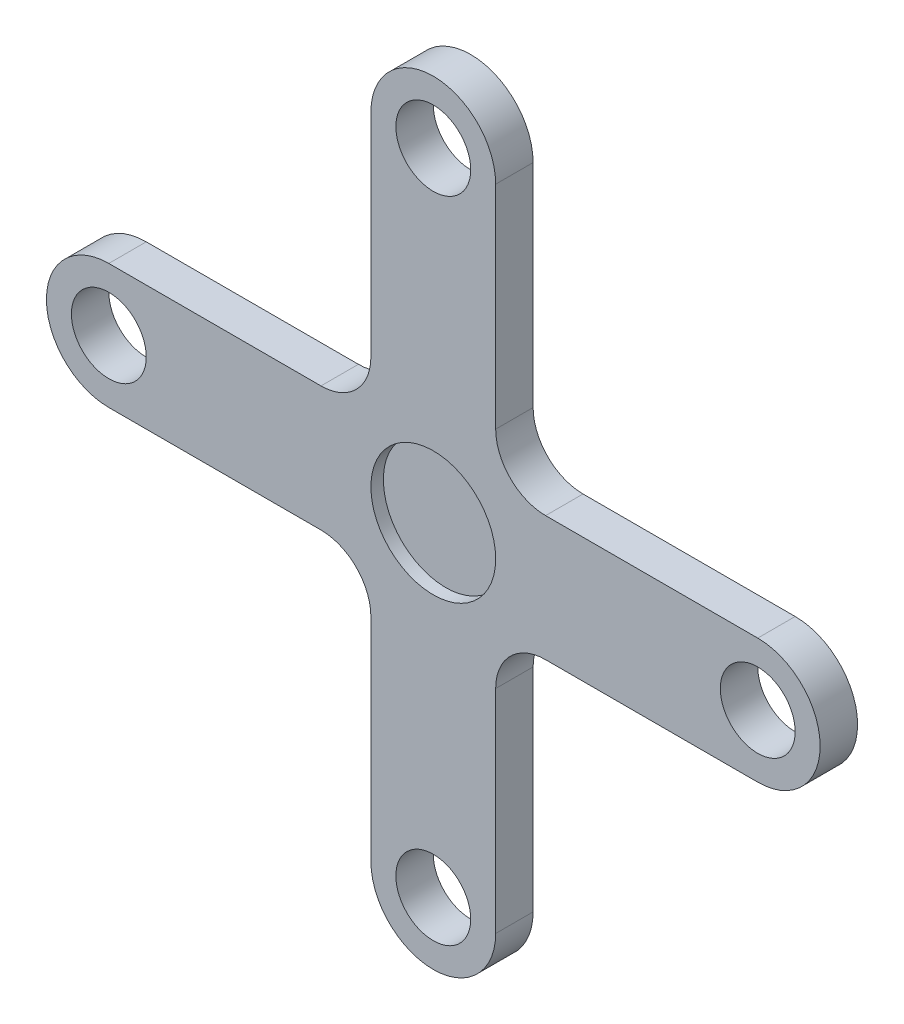
ISO-10303-21;
HEADER;
FILE_DESCRIPTION(('STEP AP214'),'2;1');
FILE_NAME('part.step','',(''),(''),'','','');
FILE_SCHEMA(('AUTOMOTIVE_DESIGN { 1 0 10303 214 1 1 1 1 }'));
ENDSEC;
DATA;
#1=APPLICATION_CONTEXT('core data for automotive mechanical design processes');
#2=APPLICATION_PROTOCOL_DEFINITION('international standard','automotive_design',2000,#1);
#3=PRODUCT_CONTEXT('',#1,'mechanical');
#4=PRODUCT('Part','Part','',(#3));
#5=PRODUCT_RELATED_PRODUCT_CATEGORY('part','',(#4));
#6=PRODUCT_DEFINITION_FORMATION('','',#4);
#7=PRODUCT_DEFINITION_CONTEXT('part definition',#1,'design');
#8=PRODUCT_DEFINITION('design','',#6,#7);
#9=PRODUCT_DEFINITION_SHAPE('','',#8);
#10=(LENGTH_UNIT() NAMED_UNIT(*) SI_UNIT(.MILLI.,.METRE.));
#11=(NAMED_UNIT(*) PLANE_ANGLE_UNIT() SI_UNIT($,.RADIAN.));
#12=(NAMED_UNIT(*) SI_UNIT($,.STERADIAN.) SOLID_ANGLE_UNIT());
#13=UNCERTAINTY_MEASURE_WITH_UNIT(LENGTH_MEASURE(1.E-05),#10,'distance_accuracy_value','');
#14=(GEOMETRIC_REPRESENTATION_CONTEXT(3) GLOBAL_UNCERTAINTY_ASSIGNED_CONTEXT((#13)) GLOBAL_UNIT_ASSIGNED_CONTEXT((#10,
#11,#12)) REPRESENTATION_CONTEXT('',''));
#15=CARTESIAN_POINT('',(0.,0.,0.));
#16=DIRECTION('',(0.,0.,1.));
#17=DIRECTION('',(1.,0.,0.));
#18=AXIS2_PLACEMENT_3D('',#15,#16,#17);
#19=CARTESIAN_POINT('',(0.,-13.,1.5));
#20=DIRECTION('',(0.,0.,1.));
#21=DIRECTION('',(1.,0.,0.));
#22=AXIS2_PLACEMENT_3D('',#19,#20,#21);
#23=PLANE('',#22);
#24=CARTESIAN_POINT('',(0.,0.,1.5));
#25=DIRECTION('',(0.,0.,1.));
#26=DIRECTION('',(1.,0.,0.));
#27=AXIS2_PLACEMENT_3D('',#24,#25,#26);
#28=CIRCLE('',#27,2.5);
#29=CARTESIAN_POINT('',(2.5,0.,1.5));
#30=VERTEX_POINT('',#29);
#31=EDGE_CURVE('E342',#30,#30,#28,.T.);
#32=ORIENTED_EDGE('',*,*,#31,.F.);
#33=EDGE_LOOP('',(#32));
#34=FACE_BOUND('',#33,.T.);
#35=CARTESIAN_POINT('',(7.31865969776296E-13,-13.,1.5));
#36=DIRECTION('',(0.,0.,1.));
#37=DIRECTION('',(1.,0.,0.));
#38=AXIS2_PLACEMENT_3D('',#35,#36,#37);
#39=CIRCLE('',#38,1.50000000000078);
#40=CARTESIAN_POINT('',(1.50000000000151,-13.,1.5));
#41=VERTEX_POINT('',#40);
#42=EDGE_CURVE('E353',#41,#41,#39,.T.);
#43=ORIENTED_EDGE('',*,*,#42,.F.);
#44=EDGE_LOOP('',(#43));
#45=FACE_BOUND('',#44,.T.);
#46=CARTESIAN_POINT('',(0.,13.,1.5));
#47=DIRECTION('',(0.,0.,1.));
#48=DIRECTION('',(1.,0.,0.));
#49=AXIS2_PLACEMENT_3D('',#46,#47,#48);
#50=CIRCLE('',#49,1.5);
#51=CARTESIAN_POINT('',(1.5,13.,1.5));
#52=VERTEX_POINT('',#51);
#53=EDGE_CURVE('E181',#52,#52,#50,.T.);
#54=ORIENTED_EDGE('',*,*,#53,.F.);
#55=EDGE_LOOP('',(#54));
#56=FACE_BOUND('',#55,.T.);
#57=CARTESIAN_POINT('',(0.,-13.,1.5));
#58=DIRECTION('',(0.,0.,1.));
#59=DIRECTION('',(1.,0.,0.));
#60=AXIS2_PLACEMENT_3D('',#57,#58,#59);
#61=CIRCLE('',#60,2.5);
#62=CARTESIAN_POINT('',(-2.5,-13.,1.5));
#63=VERTEX_POINT('',#62);
#64=CARTESIAN_POINT('',(2.5,-13.,1.5));
#65=VERTEX_POINT('',#64);
#66=EDGE_CURVE('E208',#63,#65,#61,.T.);
#67=ORIENTED_EDGE('',*,*,#66,.T.);
#68=DIRECTION('',(0.,1.,0.));
#69=VECTOR('',#68,1.);
#70=CARTESIAN_POINT('',(2.5,-13.,1.5));
#71=LINE('',#70,#69);
#72=CARTESIAN_POINT('',(2.5,-4.50000000000002,1.5));
#73=VERTEX_POINT('',#72);
#74=EDGE_CURVE('E116',#65,#73,#71,.T.);
#75=ORIENTED_EDGE('',*,*,#74,.T.);
#76=CARTESIAN_POINT('',(4.5,-4.5,1.5));
#77=DIRECTION('',(0.,0.,-1.));
#78=DIRECTION('',(1.,0.,0.));
#79=AXIS2_PLACEMENT_3D('',#76,#77,#78);
#80=CIRCLE('',#79,2.);
#81=CARTESIAN_POINT('',(4.50000000000002,-2.5,1.5));
#82=VERTEX_POINT('',#81);
#83=EDGE_CURVE('E247',#73,#82,#80,.T.);
#84=ORIENTED_EDGE('',*,*,#83,.T.);
#85=DIRECTION('',(1.,0.,0.));
#86=VECTOR('',#85,1.);
#87=CARTESIAN_POINT('',(4.50000000000002,-2.5,1.5));
#88=LINE('',#87,#86);
#89=CARTESIAN_POINT('',(13.,-2.5,1.5));
#90=VERTEX_POINT('',#89);
#91=EDGE_CURVE('E266',#82,#90,#88,.T.);
#92=ORIENTED_EDGE('',*,*,#91,.T.);
#93=CARTESIAN_POINT('',(13.,0.,1.5));
#94=DIRECTION('',(0.,0.,1.));
#95=DIRECTION('',(1.,0.,0.));
#96=AXIS2_PLACEMENT_3D('',#93,#94,#95);
#97=CIRCLE('',#96,2.5);
#98=CARTESIAN_POINT('',(13.,2.50000000000001,1.5));
#99=VERTEX_POINT('',#98);
#100=EDGE_CURVE('E263',#90,#99,#97,.T.);
#101=ORIENTED_EDGE('',*,*,#100,.T.);
#102=DIRECTION('',(-1.,0.,0.));
#103=VECTOR('',#102,1.);
#104=CARTESIAN_POINT('',(4.50000000000002,2.50000000000001,1.5));
#105=LINE('',#104,#103);
#106=CARTESIAN_POINT('',(4.50000000000002,2.50000000000001,1.5));
#107=VERTEX_POINT('',#106);
#108=EDGE_CURVE('E265',#99,#107,#105,.T.);
#109=ORIENTED_EDGE('',*,*,#108,.T.);
#110=CARTESIAN_POINT('',(4.5,4.50000000000001,1.5));
#111=DIRECTION('',(0.,0.,-1.));
#112=DIRECTION('',(1.,0.,0.));
#113=AXIS2_PLACEMENT_3D('',#110,#111,#112);
#114=CIRCLE('',#113,2.);
#115=CARTESIAN_POINT('',(2.5,4.50000000000002,1.5));
#116=VERTEX_POINT('',#115);
#117=EDGE_CURVE('E268',#107,#116,#114,.T.);
#118=ORIENTED_EDGE('',*,*,#117,.T.);
#119=DIRECTION('',(0.,1.,0.));
#120=VECTOR('',#119,1.);
#121=CARTESIAN_POINT('',(2.5,4.50000000000002,1.5));
#122=LINE('',#121,#120);
#123=CARTESIAN_POINT('',(2.5,13.,1.5));
#124=VERTEX_POINT('',#123);
#125=EDGE_CURVE('E274',#116,#124,#122,.T.);
#126=ORIENTED_EDGE('',*,*,#125,.T.);
#127=CARTESIAN_POINT('',(0.,13.,1.5));
#128=DIRECTION('',(0.,0.,1.));
#129=DIRECTION('',(1.,0.,0.));
#130=AXIS2_PLACEMENT_3D('',#127,#128,#129);
#131=CIRCLE('',#130,2.5);
#132=CARTESIAN_POINT('',(-2.50000000000001,13.,1.5));
#133=VERTEX_POINT('',#132);
#134=EDGE_CURVE('E276',#124,#133,#131,.T.);
#135=ORIENTED_EDGE('',*,*,#134,.T.);
#136=DIRECTION('',(0.,-1.,0.));
#137=VECTOR('',#136,1.);
#138=CARTESIAN_POINT('',(-2.50000000000001,4.50000000000002,1.5));
#139=LINE('',#138,#137);
#140=CARTESIAN_POINT('',(-2.50000000000001,4.50000000000001,1.5));
#141=VERTEX_POINT('',#140);
#142=EDGE_CURVE('E278',#133,#141,#139,.T.);
#143=ORIENTED_EDGE('',*,*,#142,.T.);
#144=CARTESIAN_POINT('',(-4.50000000000001,4.50000000000001,1.5));
#145=DIRECTION('',(0.,0.,-1.));
#146=DIRECTION('',(1.,0.,0.));
#147=AXIS2_PLACEMENT_3D('',#144,#145,#146);
#148=CIRCLE('',#147,2.);
#149=CARTESIAN_POINT('',(-4.50000000000002,2.50000000000001,1.5));
#150=VERTEX_POINT('',#149);
#151=EDGE_CURVE('E280',#141,#150,#148,.T.);
#152=ORIENTED_EDGE('',*,*,#151,.T.);
#153=DIRECTION('',(-1.,0.,0.));
#154=VECTOR('',#153,1.);
#155=CARTESIAN_POINT('',(-13.,2.5,1.5));
#156=LINE('',#155,#154);
#157=CARTESIAN_POINT('',(-13.,2.5,1.5));
#158=VERTEX_POINT('',#157);
#159=EDGE_CURVE('E282',#150,#158,#156,.T.);
#160=ORIENTED_EDGE('',*,*,#159,.T.);
#161=CARTESIAN_POINT('',(-13.,0.,1.5));
#162=DIRECTION('',(0.,0.,1.));
#163=DIRECTION('',(1.,0.,0.));
#164=AXIS2_PLACEMENT_3D('',#161,#162,#163);
#165=CIRCLE('',#164,2.5);
#166=CARTESIAN_POINT('',(-13.,-2.5,1.5));
#167=VERTEX_POINT('',#166);
#168=EDGE_CURVE('E159',#158,#167,#165,.T.);
#169=ORIENTED_EDGE('',*,*,#168,.T.);
#170=DIRECTION('',(1.,0.,0.));
#171=VECTOR('',#170,1.);
#172=CARTESIAN_POINT('',(-13.,-2.5,1.5));
#173=LINE('',#172,#171);
#174=CARTESIAN_POINT('',(-4.50000000000002,-2.5,1.5));
#175=VERTEX_POINT('',#174);
#176=EDGE_CURVE('E153',#167,#175,#173,.T.);
#177=ORIENTED_EDGE('',*,*,#176,.T.);
#178=CARTESIAN_POINT('',(-4.50000000000001,-4.5,1.5));
#179=DIRECTION('',(0.,0.,-1.));
#180=DIRECTION('',(1.,0.,0.));
#181=AXIS2_PLACEMENT_3D('',#178,#179,#180);
#182=CIRCLE('',#181,2.);
#183=CARTESIAN_POINT('',(-2.50000000000001,-4.50000000000002,1.5));
#184=VERTEX_POINT('',#183);
#185=EDGE_CURVE('E157',#175,#184,#182,.T.);
#186=ORIENTED_EDGE('',*,*,#185,.T.);
#187=DIRECTION('',(0.,-1.,0.));
#188=VECTOR('',#187,1.);
#189=CARTESIAN_POINT('',(-2.5,-13.,1.5));
#190=LINE('',#189,#188);
#191=EDGE_CURVE('E49',#184,#63,#190,.T.);
#192=ORIENTED_EDGE('',*,*,#191,.T.);
#193=EDGE_LOOP('',(#67,#75,#84,#92,#101,#109,#118,#126,#135,#143,#152,#160,#169,#177,#186,#192));
#194=FACE_BOUND('',#193,.T.);
#195=CARTESIAN_POINT('',(13.0000000000004,3.6875191053661E-13,1.5));
#196=DIRECTION('',(0.,0.,1.));
#197=DIRECTION('',(1.,0.,0.));
#198=AXIS2_PLACEMENT_3D('',#195,#196,#197);
#199=CIRCLE('',#198,1.50000000000028);
#200=CARTESIAN_POINT('',(14.5000000000007,3.6875191053661E-13,1.5));
#201=VERTEX_POINT('',#200);
#202=EDGE_CURVE('E359',#201,#201,#199,.T.);
#203=ORIENTED_EDGE('',*,*,#202,.F.);
#204=EDGE_LOOP('',(#203));
#205=FACE_BOUND('',#204,.T.);
#206=CARTESIAN_POINT('',(-12.9999999999996,-3.70343951375502E-13,1.5));
#207=DIRECTION('',(0.,0.,1.));
#208=DIRECTION('',(1.,0.,0.));
#209=AXIS2_PLACEMENT_3D('',#206,#207,#208);
#210=CIRCLE('',#209,1.50000000000059);
#211=CARTESIAN_POINT('',(-11.4999999999991,-3.70343951375502E-13,1.5));
#212=VERTEX_POINT('',#211);
#213=EDGE_CURVE('E345',#212,#212,#210,.T.);
#214=ORIENTED_EDGE('',*,*,#213,.F.);
#215=EDGE_LOOP('',(#214));
#216=FACE_BOUND('',#215,.T.);
#217=ADVANCED_FACE('F32',(#34,#45,#56,#194,#205,#216),#23,.T.);
#218=CARTESIAN_POINT('',(0.,-13.,0.));
#219=DIRECTION('',(0.,0.,1.));
#220=DIRECTION('',(1.,0.,0.));
#221=AXIS2_PLACEMENT_3D('',#218,#219,#220);
#222=PLANE('',#221);
#223=CARTESIAN_POINT('',(0.,-13.,0.));
#224=DIRECTION('',(0.,0.,1.));
#225=DIRECTION('',(1.,0.,0.));
#226=AXIS2_PLACEMENT_3D('',#223,#224,#225);
#227=CIRCLE('',#226,2.5);
#228=CARTESIAN_POINT('',(-2.5,-13.,0.));
#229=VERTEX_POINT('',#228);
#230=CARTESIAN_POINT('',(2.5,-13.,0.));
#231=VERTEX_POINT('',#230);
#232=EDGE_CURVE('E177',#229,#231,#227,.T.);
#233=ORIENTED_EDGE('',*,*,#232,.F.);
#234=DIRECTION('',(0.,-1.,0.));
#235=VECTOR('',#234,1.);
#236=CARTESIAN_POINT('',(-2.5,-13.,0.));
#237=LINE('',#236,#235);
#238=CARTESIAN_POINT('',(-2.50000000000001,-4.50000000000002,0.));
#239=VERTEX_POINT('',#238);
#240=EDGE_CURVE('E108',#239,#229,#237,.T.);
#241=ORIENTED_EDGE('',*,*,#240,.F.);
#242=CARTESIAN_POINT('',(-4.50000000000001,-4.5,0.));
#243=DIRECTION('',(0.,0.,-1.));
#244=DIRECTION('',(1.,0.,0.));
#245=AXIS2_PLACEMENT_3D('',#242,#243,#244);
#246=CIRCLE('',#245,2.);
#247=CARTESIAN_POINT('',(-4.50000000000002,-2.5,0.));
#248=VERTEX_POINT('',#247);
#249=EDGE_CURVE('E102',#248,#239,#246,.T.);
#250=ORIENTED_EDGE('',*,*,#249,.F.);
#251=DIRECTION('',(1.,0.,0.));
#252=VECTOR('',#251,1.);
#253=CARTESIAN_POINT('',(-13.,-2.5,0.));
#254=LINE('',#253,#252);
#255=CARTESIAN_POINT('',(-13.,-2.5,0.));
#256=VERTEX_POINT('',#255);
#257=EDGE_CURVE('E167',#256,#248,#254,.T.);
#258=ORIENTED_EDGE('',*,*,#257,.F.);
#259=CARTESIAN_POINT('',(-13.,0.,0.));
#260=DIRECTION('',(0.,0.,1.));
#261=DIRECTION('',(1.,0.,0.));
#262=AXIS2_PLACEMENT_3D('',#259,#260,#261);
#263=CIRCLE('',#262,2.5);
#264=CARTESIAN_POINT('',(-13.,2.5,0.));
#265=VERTEX_POINT('',#264);
#266=EDGE_CURVE('E203',#265,#256,#263,.T.);
#267=ORIENTED_EDGE('',*,*,#266,.F.);
#268=DIRECTION('',(-1.,0.,0.));
#269=VECTOR('',#268,1.);
#270=CARTESIAN_POINT('',(-13.,2.5,0.));
#271=LINE('',#270,#269);
#272=CARTESIAN_POINT('',(-4.50000000000002,2.50000000000001,0.));
#273=VERTEX_POINT('',#272);
#274=EDGE_CURVE('E201',#273,#265,#271,.T.);
#275=ORIENTED_EDGE('',*,*,#274,.F.);
#276=CARTESIAN_POINT('',(-4.50000000000001,4.50000000000001,0.));
#277=DIRECTION('',(0.,0.,-1.));
#278=DIRECTION('',(1.,0.,0.));
#279=AXIS2_PLACEMENT_3D('',#276,#277,#278);
#280=CIRCLE('',#279,2.);
#281=CARTESIAN_POINT('',(-2.50000000000001,4.50000000000001,0.));
#282=VERTEX_POINT('',#281);
#283=EDGE_CURVE('E199',#282,#273,#280,.T.);
#284=ORIENTED_EDGE('',*,*,#283,.F.);
#285=DIRECTION('',(0.,-1.,0.));
#286=VECTOR('',#285,1.);
#287=CARTESIAN_POINT('',(-2.50000000000001,4.50000000000002,0.));
#288=LINE('',#287,#286);
#289=CARTESIAN_POINT('',(-2.50000000000001,13.,0.));
#290=VERTEX_POINT('',#289);
#291=EDGE_CURVE('E197',#290,#282,#288,.T.);
#292=ORIENTED_EDGE('',*,*,#291,.F.);
#293=CARTESIAN_POINT('',(0.,13.,0.));
#294=DIRECTION('',(0.,0.,1.));
#295=DIRECTION('',(1.,0.,0.));
#296=AXIS2_PLACEMENT_3D('',#293,#294,#295);
#297=CIRCLE('',#296,2.5);
#298=CARTESIAN_POINT('',(2.5,13.,0.));
#299=VERTEX_POINT('',#298);
#300=EDGE_CURVE('E195',#299,#290,#297,.T.);
#301=ORIENTED_EDGE('',*,*,#300,.F.);
#302=DIRECTION('',(0.,1.,0.));
#303=VECTOR('',#302,1.);
#304=CARTESIAN_POINT('',(2.5,4.50000000000002,0.));
#305=LINE('',#304,#303);
#306=CARTESIAN_POINT('',(2.5,4.50000000000002,0.));
#307=VERTEX_POINT('',#306);
#308=EDGE_CURVE('E193',#307,#299,#305,.T.);
#309=ORIENTED_EDGE('',*,*,#308,.F.);
#310=CARTESIAN_POINT('',(4.5,4.50000000000001,0.));
#311=DIRECTION('',(0.,0.,-1.));
#312=DIRECTION('',(1.,0.,0.));
#313=AXIS2_PLACEMENT_3D('',#310,#311,#312);
#314=CIRCLE('',#313,2.);
#315=CARTESIAN_POINT('',(4.50000000000002,2.50000000000001,0.));
#316=VERTEX_POINT('',#315);
#317=EDGE_CURVE('E191',#316,#307,#314,.T.);
#318=ORIENTED_EDGE('',*,*,#317,.F.);
#319=DIRECTION('',(-1.,0.,0.));
#320=VECTOR('',#319,1.);
#321=CARTESIAN_POINT('',(4.50000000000002,2.50000000000001,0.));
#322=LINE('',#321,#320);
#323=CARTESIAN_POINT('',(13.,2.50000000000001,0.));
#324=VERTEX_POINT('',#323);
#325=EDGE_CURVE('E189',#324,#316,#322,.T.);
#326=ORIENTED_EDGE('',*,*,#325,.F.);
#327=CARTESIAN_POINT('',(13.,0.,0.));
#328=DIRECTION('',(0.,0.,1.));
#329=DIRECTION('',(1.,0.,0.));
#330=AXIS2_PLACEMENT_3D('',#327,#328,#329);
#331=CIRCLE('',#330,2.5);
#332=CARTESIAN_POINT('',(13.,-2.5,0.));
#333=VERTEX_POINT('',#332);
#334=EDGE_CURVE('E187',#333,#324,#331,.T.);
#335=ORIENTED_EDGE('',*,*,#334,.F.);
#336=DIRECTION('',(1.,0.,0.));
#337=VECTOR('',#336,1.);
#338=CARTESIAN_POINT('',(4.50000000000002,-2.5,0.));
#339=LINE('',#338,#337);
#340=CARTESIAN_POINT('',(4.50000000000002,-2.5,0.));
#341=VERTEX_POINT('',#340);
#342=EDGE_CURVE('E185',#341,#333,#339,.T.);
#343=ORIENTED_EDGE('',*,*,#342,.F.);
#344=CARTESIAN_POINT('',(4.5,-4.5,0.));
#345=DIRECTION('',(0.,0.,-1.));
#346=DIRECTION('',(1.,0.,0.));
#347=AXIS2_PLACEMENT_3D('',#344,#345,#346);
#348=CIRCLE('',#347,2.);
#349=CARTESIAN_POINT('',(2.5,-4.50000000000002,0.));
#350=VERTEX_POINT('',#349);
#351=EDGE_CURVE('E183',#350,#341,#348,.T.);
#352=ORIENTED_EDGE('',*,*,#351,.F.);
#353=DIRECTION('',(0.,1.,0.));
#354=VECTOR('',#353,1.);
#355=CARTESIAN_POINT('',(2.5,-13.,0.));
#356=LINE('',#355,#354);
#357=EDGE_CURVE('E180',#231,#350,#356,.T.);
#358=ORIENTED_EDGE('',*,*,#357,.F.);
#359=EDGE_LOOP('',(#233,#241,#250,#258,#267,#275,#284,#292,#301,#309,#318,#326,#335,#343,#352,#358));
#360=FACE_BOUND('',#359,.T.);
#361=CARTESIAN_POINT('',(0.,13.,0.));
#362=DIRECTION('',(0.,0.,1.));
#363=DIRECTION('',(1.,0.,0.));
#364=AXIS2_PLACEMENT_3D('',#361,#362,#363);
#365=CIRCLE('',#364,1.5);
#366=CARTESIAN_POINT('',(1.5,13.,0.));
#367=VERTEX_POINT('',#366);
#368=EDGE_CURVE('E362',#367,#367,#365,.T.);
#369=ORIENTED_EDGE('',*,*,#368,.T.);
#370=EDGE_LOOP('',(#369));
#371=FACE_BOUND('',#370,.T.);
#372=CARTESIAN_POINT('',(13.0000000000004,3.6875191053661E-13,0.));
#373=DIRECTION('',(0.,0.,1.));
#374=DIRECTION('',(1.,0.,0.));
#375=AXIS2_PLACEMENT_3D('',#372,#373,#374);
#376=CIRCLE('',#375,1.50000000000028);
#377=CARTESIAN_POINT('',(14.5000000000007,3.6875191053661E-13,0.));
#378=VERTEX_POINT('',#377);
#379=EDGE_CURVE('E356',#378,#378,#376,.T.);
#380=ORIENTED_EDGE('',*,*,#379,.T.);
#381=EDGE_LOOP('',(#380));
#382=FACE_BOUND('',#381,.T.);
#383=CARTESIAN_POINT('',(7.31865969776296E-13,-13.,0.));
#384=DIRECTION('',(0.,0.,1.));
#385=DIRECTION('',(1.,0.,0.));
#386=AXIS2_PLACEMENT_3D('',#383,#384,#385);
#387=CIRCLE('',#386,1.50000000000078);
#388=CARTESIAN_POINT('',(1.50000000000151,-13.,0.));
#389=VERTEX_POINT('',#388);
#390=EDGE_CURVE('E351',#389,#389,#387,.T.);
#391=ORIENTED_EDGE('',*,*,#390,.T.);
#392=EDGE_LOOP('',(#391));
#393=FACE_BOUND('',#392,.T.);
#394=CARTESIAN_POINT('',(-12.9999999999996,-3.70343951375502E-13,0.));
#395=DIRECTION('',(0.,0.,1.));
#396=DIRECTION('',(1.,0.,0.));
#397=AXIS2_PLACEMENT_3D('',#394,#395,#396);
#398=CIRCLE('',#397,1.50000000000059);
#399=CARTESIAN_POINT('',(-11.4999999999991,-3.70343951375502E-13,0.));
#400=VERTEX_POINT('',#399);
#401=EDGE_CURVE('E341',#400,#400,#398,.T.);
#402=ORIENTED_EDGE('',*,*,#401,.T.);
#403=EDGE_LOOP('',(#402));
#404=FACE_BOUND('',#403,.T.);
#405=ADVANCED_FACE('F251',(#360,#371,#382,#393,#404),#222,.F.);
#406=CARTESIAN_POINT('',(0.,-13.,1.5));
#407=DIRECTION('',(0.,0.,-1.));
#408=DIRECTION('',(-1.,0.,0.));
#409=AXIS2_PLACEMENT_3D('',#406,#407,#408);
#410=CYLINDRICAL_SURFACE('',#409,2.5);
#411=ORIENTED_EDGE('',*,*,#232,.T.);
#412=DIRECTION('',(0.,0.,-1.));
#413=VECTOR('',#412,1.);
#414=CARTESIAN_POINT('',(2.5,-13.,1.5));
#415=LINE('',#414,#413);
#416=EDGE_CURVE('E11',#65,#231,#415,.T.);
#417=ORIENTED_EDGE('',*,*,#416,.F.);
#418=ORIENTED_EDGE('',*,*,#66,.F.);
#419=DIRECTION('',(0.,0.,-1.));
#420=VECTOR('',#419,1.);
#421=CARTESIAN_POINT('',(-2.5,-13.,1.5));
#422=LINE('',#421,#420);
#423=EDGE_CURVE('E173',#63,#229,#422,.T.);
#424=ORIENTED_EDGE('',*,*,#423,.T.);
#425=EDGE_LOOP('',(#411,#417,#418,#424));
#426=FACE_BOUND('',#425,.T.);
#427=ADVANCED_FACE('F34',(#426),#410,.T.);
#428=CARTESIAN_POINT('',(2.5,-13.,1.5));
#429=DIRECTION('',(-1.,0.,0.));
#430=DIRECTION('',(0.,-1.,0.));
#431=AXIS2_PLACEMENT_3D('',#428,#429,#430);
#432=PLANE('',#431);
#433=ORIENTED_EDGE('',*,*,#357,.T.);
#434=DIRECTION('',(0.,0.,-1.));
#435=VECTOR('',#434,1.);
#436=CARTESIAN_POINT('',(2.5,-4.50000000000002,1.5));
#437=LINE('',#436,#435);
#438=EDGE_CURVE('E41',#73,#350,#437,.T.);
#439=ORIENTED_EDGE('',*,*,#438,.F.);
#440=ORIENTED_EDGE('',*,*,#74,.F.);
#441=ORIENTED_EDGE('',*,*,#416,.T.);
#442=EDGE_LOOP('',(#433,#439,#440,#441));
#443=FACE_BOUND('',#442,.T.);
#444=ADVANCED_FACE('F527',(#443),#432,.F.);
#445=CARTESIAN_POINT('',(4.5,-4.5,1.5));
#446=DIRECTION('',(0.,0.,-1.));
#447=DIRECTION('',(-1.,0.,0.));
#448=AXIS2_PLACEMENT_3D('',#445,#446,#447);
#449=CYLINDRICAL_SURFACE('',#448,2.);
#450=ORIENTED_EDGE('',*,*,#351,.T.);
#451=DIRECTION('',(0.,0.,-1.));
#452=VECTOR('',#451,1.);
#453=CARTESIAN_POINT('',(4.50000000000002,-2.5,1.5));
#454=LINE('',#453,#452);
#455=EDGE_CURVE('E239',#82,#341,#454,.T.);
#456=ORIENTED_EDGE('',*,*,#455,.F.);
#457=ORIENTED_EDGE('',*,*,#83,.F.);
#458=ORIENTED_EDGE('',*,*,#438,.T.);
#459=EDGE_LOOP('',(#450,#456,#457,#458));
#460=FACE_BOUND('',#459,.T.);
#461=ADVANCED_FACE('F245',(#460),#449,.F.);
#462=CARTESIAN_POINT('',(4.50000000000002,-2.5,1.5));
#463=DIRECTION('',(0.,1.,0.));
#464=DIRECTION('',(-1.,0.,0.));
#465=AXIS2_PLACEMENT_3D('',#462,#463,#464);
#466=PLANE('',#465);
#467=ORIENTED_EDGE('',*,*,#342,.T.);
#468=DIRECTION('',(0.,0.,-1.));
#469=VECTOR('',#468,1.);
#470=CARTESIAN_POINT('',(13.,-2.5,1.5));
#471=LINE('',#470,#469);
#472=EDGE_CURVE('E236',#90,#333,#471,.T.);
#473=ORIENTED_EDGE('',*,*,#472,.F.);
#474=ORIENTED_EDGE('',*,*,#91,.F.);
#475=ORIENTED_EDGE('',*,*,#455,.T.);
#476=EDGE_LOOP('',(#467,#473,#474,#475));
#477=FACE_BOUND('',#476,.T.);
#478=ADVANCED_FACE('F257',(#477),#466,.F.);
#479=CARTESIAN_POINT('',(13.,0.,1.5));
#480=DIRECTION('',(0.,0.,-1.));
#481=DIRECTION('',(-1.,0.,0.));
#482=AXIS2_PLACEMENT_3D('',#479,#480,#481);
#483=CYLINDRICAL_SURFACE('',#482,2.5);
#484=ORIENTED_EDGE('',*,*,#334,.T.);
#485=DIRECTION('',(0.,0.,-1.));
#486=VECTOR('',#485,1.);
#487=CARTESIAN_POINT('',(13.,2.50000000000001,1.5));
#488=LINE('',#487,#486);
#489=EDGE_CURVE('E233',#99,#324,#488,.T.);
#490=ORIENTED_EDGE('',*,*,#489,.F.);
#491=ORIENTED_EDGE('',*,*,#100,.F.);
#492=ORIENTED_EDGE('',*,*,#472,.T.);
#493=EDGE_LOOP('',(#484,#490,#491,#492));
#494=FACE_BOUND('',#493,.T.);
#495=ADVANCED_FACE('F261',(#494),#483,.T.);
#496=CARTESIAN_POINT('',(4.50000000000002,2.50000000000001,1.5));
#497=DIRECTION('',(0.,-1.,0.));
#498=DIRECTION('',(1.,0.,0.));
#499=AXIS2_PLACEMENT_3D('',#496,#497,#498);
#500=PLANE('',#499);
#501=ORIENTED_EDGE('',*,*,#325,.T.);
#502=DIRECTION('',(0.,0.,-1.));
#503=VECTOR('',#502,1.);
#504=CARTESIAN_POINT('',(4.50000000000002,2.50000000000001,1.5));
#505=LINE('',#504,#503);
#506=EDGE_CURVE('E230',#107,#316,#505,.T.);
#507=ORIENTED_EDGE('',*,*,#506,.F.);
#508=ORIENTED_EDGE('',*,*,#108,.F.);
#509=ORIENTED_EDGE('',*,*,#489,.T.);
#510=EDGE_LOOP('',(#501,#507,#508,#509));
#511=FACE_BOUND('',#510,.T.);
#512=ADVANCED_FACE('F492',(#511),#500,.F.);
#513=CARTESIAN_POINT('',(4.5,4.50000000000001,1.5));
#514=DIRECTION('',(0.,0.,-1.));
#515=DIRECTION('',(-1.,0.,0.));
#516=AXIS2_PLACEMENT_3D('',#513,#514,#515);
#517=CYLINDRICAL_SURFACE('',#516,2.);
#518=ORIENTED_EDGE('',*,*,#317,.T.);
#519=DIRECTION('',(0.,0.,-1.));
#520=VECTOR('',#519,1.);
#521=CARTESIAN_POINT('',(2.5,4.50000000000002,1.5));
#522=LINE('',#521,#520);
#523=EDGE_CURVE('E227',#116,#307,#522,.T.);
#524=ORIENTED_EDGE('',*,*,#523,.F.);
#525=ORIENTED_EDGE('',*,*,#117,.F.);
#526=ORIENTED_EDGE('',*,*,#506,.T.);
#527=EDGE_LOOP('',(#518,#524,#525,#526));
#528=FACE_BOUND('',#527,.T.);
#529=ADVANCED_FACE('F482',(#528),#517,.F.);
#530=CARTESIAN_POINT('',(2.5,4.50000000000002,1.5));
#531=DIRECTION('',(-1.,0.,0.));
#532=DIRECTION('',(0.,-1.,0.));
#533=AXIS2_PLACEMENT_3D('',#530,#531,#532);
#534=PLANE('',#533);
#535=ORIENTED_EDGE('',*,*,#308,.T.);
#536=DIRECTION('',(0.,0.,-1.));
#537=VECTOR('',#536,1.);
#538=CARTESIAN_POINT('',(2.5,13.,1.5));
#539=LINE('',#538,#537);
#540=EDGE_CURVE('E224',#124,#299,#539,.T.);
#541=ORIENTED_EDGE('',*,*,#540,.F.);
#542=ORIENTED_EDGE('',*,*,#125,.F.);
#543=ORIENTED_EDGE('',*,*,#523,.T.);
#544=EDGE_LOOP('',(#535,#541,#542,#543));
#545=FACE_BOUND('',#544,.T.);
#546=ADVANCED_FACE('F472',(#545),#534,.F.);
#547=CARTESIAN_POINT('',(0.,13.,1.5));
#548=DIRECTION('',(0.,0.,-1.));
#549=DIRECTION('',(-1.,0.,0.));
#550=AXIS2_PLACEMENT_3D('',#547,#548,#549);
#551=CYLINDRICAL_SURFACE('',#550,2.5);
#552=ORIENTED_EDGE('',*,*,#300,.T.);
#553=DIRECTION('',(0.,0.,-1.));
#554=VECTOR('',#553,1.);
#555=CARTESIAN_POINT('',(-2.50000000000001,13.,1.5));
#556=LINE('',#555,#554);
#557=EDGE_CURVE('E221',#133,#290,#556,.T.);
#558=ORIENTED_EDGE('',*,*,#557,.F.);
#559=ORIENTED_EDGE('',*,*,#134,.F.);
#560=ORIENTED_EDGE('',*,*,#540,.T.);
#561=EDGE_LOOP('',(#552,#558,#559,#560));
#562=FACE_BOUND('',#561,.T.);
#563=ADVANCED_FACE('F462',(#562),#551,.T.);
#564=CARTESIAN_POINT('',(-2.50000000000001,4.50000000000002,1.5));
#565=DIRECTION('',(1.,0.,0.));
#566=DIRECTION('',(0.,1.,0.));
#567=AXIS2_PLACEMENT_3D('',#564,#565,#566);
#568=PLANE('',#567);
#569=ORIENTED_EDGE('',*,*,#291,.T.);
#570=DIRECTION('',(0.,0.,-1.));
#571=VECTOR('',#570,1.);
#572=CARTESIAN_POINT('',(-2.50000000000001,4.50000000000001,1.5));
#573=LINE('',#572,#571);
#574=EDGE_CURVE('E218',#141,#282,#573,.T.);
#575=ORIENTED_EDGE('',*,*,#574,.F.);
#576=ORIENTED_EDGE('',*,*,#142,.F.);
#577=ORIENTED_EDGE('',*,*,#557,.T.);
#578=EDGE_LOOP('',(#569,#575,#576,#577));
#579=FACE_BOUND('',#578,.T.);
#580=ADVANCED_FACE('F452',(#579),#568,.F.);
#581=CARTESIAN_POINT('',(-4.50000000000001,4.50000000000001,1.5));
#582=DIRECTION('',(0.,0.,-1.));
#583=DIRECTION('',(-1.,0.,0.));
#584=AXIS2_PLACEMENT_3D('',#581,#582,#583);
#585=CYLINDRICAL_SURFACE('',#584,2.);
#586=ORIENTED_EDGE('',*,*,#283,.T.);
#587=DIRECTION('',(0.,0.,-1.));
#588=VECTOR('',#587,1.);
#589=CARTESIAN_POINT('',(-4.50000000000002,2.50000000000001,1.5));
#590=LINE('',#589,#588);
#591=EDGE_CURVE('E215',#150,#273,#590,.T.);
#592=ORIENTED_EDGE('',*,*,#591,.F.);
#593=ORIENTED_EDGE('',*,*,#151,.F.);
#594=ORIENTED_EDGE('',*,*,#574,.T.);
#595=EDGE_LOOP('',(#586,#592,#593,#594));
#596=FACE_BOUND('',#595,.T.);
#597=ADVANCED_FACE('F443',(#596),#585,.F.);
#598=CARTESIAN_POINT('',(-13.,2.5,1.5));
#599=DIRECTION('',(0.,-1.,0.));
#600=DIRECTION('',(1.,0.,0.));
#601=AXIS2_PLACEMENT_3D('',#598,#599,#600);
#602=PLANE('',#601);
#603=ORIENTED_EDGE('',*,*,#274,.T.);
#604=DIRECTION('',(0.,0.,-1.));
#605=VECTOR('',#604,1.);
#606=CARTESIAN_POINT('',(-13.,2.5,1.5));
#607=LINE('',#606,#605);
#608=EDGE_CURVE('E212',#158,#265,#607,.T.);
#609=ORIENTED_EDGE('',*,*,#608,.F.);
#610=ORIENTED_EDGE('',*,*,#159,.F.);
#611=ORIENTED_EDGE('',*,*,#591,.T.);
#612=EDGE_LOOP('',(#603,#609,#610,#611));
#613=FACE_BOUND('',#612,.T.);
#614=ADVANCED_FACE('F288',(#613),#602,.F.);
#615=CARTESIAN_POINT('',(-13.,0.,1.5));
#616=DIRECTION('',(0.,0.,-1.));
#617=DIRECTION('',(-1.,0.,0.));
#618=AXIS2_PLACEMENT_3D('',#615,#616,#617);
#619=CYLINDRICAL_SURFACE('',#618,2.5);
#620=ORIENTED_EDGE('',*,*,#266,.T.);
#621=DIRECTION('',(0.,0.,-1.));
#622=VECTOR('',#621,1.);
#623=CARTESIAN_POINT('',(-13.,-2.5,1.5));
#624=LINE('',#623,#622);
#625=EDGE_CURVE('E168',#167,#256,#624,.T.);
#626=ORIENTED_EDGE('',*,*,#625,.F.);
#627=ORIENTED_EDGE('',*,*,#168,.F.);
#628=ORIENTED_EDGE('',*,*,#608,.T.);
#629=EDGE_LOOP('',(#620,#626,#627,#628));
#630=FACE_BOUND('',#629,.T.);
#631=ADVANCED_FACE('F292',(#630),#619,.T.);
#632=CARTESIAN_POINT('',(-13.,-2.5,1.5));
#633=DIRECTION('',(0.,1.,0.));
#634=DIRECTION('',(-1.,0.,0.));
#635=AXIS2_PLACEMENT_3D('',#632,#633,#634);
#636=PLANE('',#635);
#637=ORIENTED_EDGE('',*,*,#257,.T.);
#638=DIRECTION('',(0.,0.,-1.));
#639=VECTOR('',#638,1.);
#640=CARTESIAN_POINT('',(-4.50000000000002,-2.5,1.5));
#641=LINE('',#640,#639);
#642=EDGE_CURVE('E164',#175,#248,#641,.T.);
#643=ORIENTED_EDGE('',*,*,#642,.F.);
#644=ORIENTED_EDGE('',*,*,#176,.F.);
#645=ORIENTED_EDGE('',*,*,#625,.T.);
#646=EDGE_LOOP('',(#637,#643,#644,#645));
#647=FACE_BOUND('',#646,.T.);
#648=ADVANCED_FACE('F165',(#647),#636,.F.);
#649=CARTESIAN_POINT('',(-4.50000000000001,-4.5,1.5));
#650=DIRECTION('',(0.,0.,-1.));
#651=DIRECTION('',(-1.,0.,0.));
#652=AXIS2_PLACEMENT_3D('',#649,#650,#651);
#653=CYLINDRICAL_SURFACE('',#652,2.);
#654=ORIENTED_EDGE('',*,*,#249,.T.);
#655=DIRECTION('',(0.,0.,-1.));
#656=VECTOR('',#655,1.);
#657=CARTESIAN_POINT('',(-2.50000000000001,-4.50000000000002,1.5));
#658=LINE('',#657,#656);
#659=EDGE_CURVE('E169',#184,#239,#658,.T.);
#660=ORIENTED_EDGE('',*,*,#659,.F.);
#661=ORIENTED_EDGE('',*,*,#185,.F.);
#662=ORIENTED_EDGE('',*,*,#642,.T.);
#663=EDGE_LOOP('',(#654,#660,#661,#662));
#664=FACE_BOUND('',#663,.T.);
#665=ADVANCED_FACE('F171',(#664),#653,.F.);
#666=CARTESIAN_POINT('',(-2.5,-13.,1.5));
#667=DIRECTION('',(1.,0.,0.));
#668=DIRECTION('',(0.,1.,0.));
#669=AXIS2_PLACEMENT_3D('',#666,#667,#668);
#670=PLANE('',#669);
#671=ORIENTED_EDGE('',*,*,#240,.T.);
#672=ORIENTED_EDGE('',*,*,#423,.F.);
#673=ORIENTED_EDGE('',*,*,#191,.F.);
#674=ORIENTED_EDGE('',*,*,#659,.T.);
#675=EDGE_LOOP('',(#671,#672,#673,#674));
#676=FACE_BOUND('',#675,.T.);
#677=ADVANCED_FACE('F296',(#676),#670,.F.);
#678=CARTESIAN_POINT('',(0.,13.,1.5));
#679=DIRECTION('',(0.,0.,-1.));
#680=DIRECTION('',(-1.,0.,0.));
#681=AXIS2_PLACEMENT_3D('',#678,#679,#680);
#682=CYLINDRICAL_SURFACE('',#681,1.5);
#683=ORIENTED_EDGE('',*,*,#53,.T.);
#684=EDGE_LOOP('',(#683));
#685=FACE_BOUND('',#684,.T.);
#686=ORIENTED_EDGE('',*,*,#368,.F.);
#687=EDGE_LOOP('',(#686));
#688=FACE_BOUND('',#687,.T.);
#689=ADVANCED_FACE('F298',(#685,#688),#682,.F.);
#690=CARTESIAN_POINT('',(13.0000000000004,3.6875191053661E-13,1.5));
#691=DIRECTION('',(0.,0.,-1.));
#692=DIRECTION('',(-1.,0.,0.));
#693=AXIS2_PLACEMENT_3D('',#690,#691,#692);
#694=CYLINDRICAL_SURFACE('',#693,1.50000000000028);
#695=ORIENTED_EDGE('',*,*,#202,.T.);
#696=EDGE_LOOP('',(#695));
#697=FACE_BOUND('',#696,.T.);
#698=ORIENTED_EDGE('',*,*,#379,.F.);
#699=EDGE_LOOP('',(#698));
#700=FACE_BOUND('',#699,.T.);
#701=ADVANCED_FACE('F304',(#697,#700),#694,.F.);
#702=CARTESIAN_POINT('',(7.31865969776296E-13,-13.,1.5));
#703=DIRECTION('',(0.,0.,-1.));
#704=DIRECTION('',(-1.,0.,0.));
#705=AXIS2_PLACEMENT_3D('',#702,#703,#704);
#706=CYLINDRICAL_SURFACE('',#705,1.50000000000078);
#707=ORIENTED_EDGE('',*,*,#42,.T.);
#708=EDGE_LOOP('',(#707));
#709=FACE_BOUND('',#708,.T.);
#710=ORIENTED_EDGE('',*,*,#390,.F.);
#711=EDGE_LOOP('',(#710));
#712=FACE_BOUND('',#711,.T.);
#713=ADVANCED_FACE('F320',(#709,#712),#706,.F.);
#714=CARTESIAN_POINT('',(-12.9999999999996,-3.70343951375502E-13,1.5));
#715=DIRECTION('',(0.,0.,-1.));
#716=DIRECTION('',(-1.,0.,0.));
#717=AXIS2_PLACEMENT_3D('',#714,#715,#716);
#718=CYLINDRICAL_SURFACE('',#717,1.50000000000059);
#719=ORIENTED_EDGE('',*,*,#213,.T.);
#720=EDGE_LOOP('',(#719));
#721=FACE_BOUND('',#720,.T.);
#722=ORIENTED_EDGE('',*,*,#401,.F.);
#723=EDGE_LOOP('',(#722));
#724=FACE_BOUND('',#723,.T.);
#725=ADVANCED_FACE('F324',(#721,#724),#718,.F.);
#726=CARTESIAN_POINT('',(0.,0.,1.));
#727=DIRECTION('',(0.,0.,1.));
#728=DIRECTION('',(1.,0.,0.));
#729=AXIS2_PLACEMENT_3D('',#726,#727,#728);
#730=CYLINDRICAL_SURFACE('',#729,2.5);
#731=CARTESIAN_POINT('',(0.,0.,1.));
#732=DIRECTION('',(0.,0.,1.));
#733=DIRECTION('',(1.,0.,0.));
#734=AXIS2_PLACEMENT_3D('',#731,#732,#733);
#735=CIRCLE('',#734,2.5);
#736=CARTESIAN_POINT('',(2.5,0.,1.));
#737=VERTEX_POINT('',#736);
#738=EDGE_CURVE('E340',#737,#737,#735,.T.);
#739=ORIENTED_EDGE('',*,*,#738,.F.);
#740=EDGE_LOOP('',(#739));
#741=FACE_BOUND('',#740,.T.);
#742=ORIENTED_EDGE('',*,*,#31,.T.);
#743=EDGE_LOOP('',(#742));
#744=FACE_BOUND('',#743,.T.);
#745=ADVANCED_FACE('F328',(#741,#744),#730,.F.);
#746=CARTESIAN_POINT('',(0.,0.,1.));
#747=DIRECTION('',(0.,0.,1.));
#748=DIRECTION('',(1.,0.,0.));
#749=AXIS2_PLACEMENT_3D('',#746,#747,#748);
#750=PLANE('',#749);
#751=ORIENTED_EDGE('',*,*,#738,.T.);
#752=EDGE_LOOP('',(#751));
#753=FACE_BOUND('',#752,.T.);
#754=ADVANCED_FACE('F332',(#753),#750,.T.);
#755=CLOSED_SHELL('',(#217,#405,#427,#444,#461,#478,#495,#512,#529,#546,#563,#580,#597,#614,
#631,#648,#665,#677,#689,#701,#713,#725,#745,#754));
#756=MANIFOLD_SOLID_BREP('B2',#755);
#757=ADVANCED_BREP_SHAPE_REPRESENTATION('',(#18,#756),#14);
#758=SHAPE_DEFINITION_REPRESENTATION(#9,#757);
ENDSEC;
END-ISO-10303-21;
